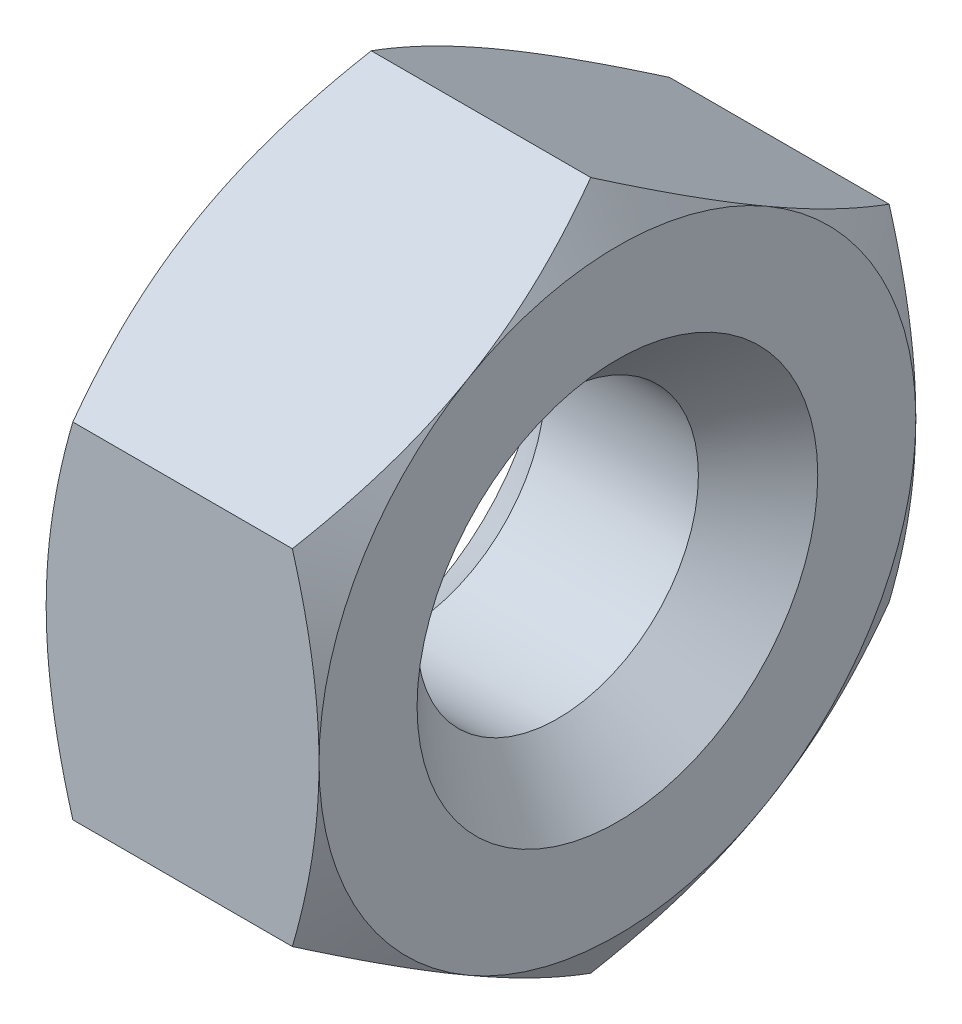
ISO-10303-21;
HEADER;
FILE_DESCRIPTION(('STEP AP214'),'2;1');
FILE_NAME('part.step','',(''),(''),'','','');
FILE_SCHEMA(('AUTOMOTIVE_DESIGN { 1 0 10303 214 1 1 1 1 }'));
ENDSEC;
DATA;
#1=APPLICATION_CONTEXT('core data for automotive mechanical design processes');
#2=APPLICATION_PROTOCOL_DEFINITION('international standard','automotive_design',2000,#1);
#3=PRODUCT_CONTEXT('',#1,'mechanical');
#4=PRODUCT('Part','Part','',(#3));
#5=PRODUCT_RELATED_PRODUCT_CATEGORY('part','',(#4));
#6=PRODUCT_DEFINITION_FORMATION('','',#4);
#7=PRODUCT_DEFINITION_CONTEXT('part definition',#1,'design');
#8=PRODUCT_DEFINITION('design','',#6,#7);
#9=PRODUCT_DEFINITION_SHAPE('','',#8);
#10=(LENGTH_UNIT() NAMED_UNIT(*) SI_UNIT(.MILLI.,.METRE.));
#11=(NAMED_UNIT(*) PLANE_ANGLE_UNIT() SI_UNIT($,.RADIAN.));
#12=(NAMED_UNIT(*) SI_UNIT($,.STERADIAN.) SOLID_ANGLE_UNIT());
#13=UNCERTAINTY_MEASURE_WITH_UNIT(LENGTH_MEASURE(1.E-05),#10,'distance_accuracy_value','');
#14=(GEOMETRIC_REPRESENTATION_CONTEXT(3) GLOBAL_UNCERTAINTY_ASSIGNED_CONTEXT((#13)) GLOBAL_UNIT_ASSIGNED_CONTEXT((#10,
#11,#12)) REPRESENTATION_CONTEXT('',''));
#15=CARTESIAN_POINT('',(0.,0.,0.));
#16=DIRECTION('',(0.,0.,1.));
#17=DIRECTION('',(1.,0.,0.));
#18=AXIS2_PLACEMENT_3D('',#15,#16,#17);
#19=CARTESIAN_POINT('',(-1.6,0.,0.));
#20=DIRECTION('',(1.,0.,0.));
#21=DIRECTION('',(0.,0.,-1.));
#22=AXIS2_PLACEMENT_3D('',#19,#20,#21);
#23=PLANE('',#22);
#24=CARTESIAN_POINT('',(-1.6,0.,0.));
#25=DIRECTION('',(1.,0.,0.));
#26=DIRECTION('',(0.,0.,-1.));
#27=AXIS2_PLACEMENT_3D('',#24,#25,#26);
#28=CIRCLE('',#27,2.35);
#29=CARTESIAN_POINT('',(-1.6,0.,-2.35));
#30=VERTEX_POINT('',#29);
#31=EDGE_CURVE('E11',#30,#30,#28,.T.);
#32=ORIENTED_EDGE('',*,*,#31,.T.);
#33=EDGE_LOOP('',(#32));
#34=FACE_BOUND('',#33,.T.);
#35=CARTESIAN_POINT('',(-1.6,0.,0.));
#36=DIRECTION('',(1.,0.,0.));
#37=DIRECTION('',(0.,0.,-1.));
#38=AXIS2_PLACEMENT_3D('',#35,#36,#37);
#39=CIRCLE('',#38,3.5);
#40=CARTESIAN_POINT('',(-1.6,0.,-3.5));
#41=VERTEX_POINT('',#40);
#42=CARTESIAN_POINT('',(-1.6,3.03108891324553,-1.75));
#43=VERTEX_POINT('',#42);
#44=EDGE_CURVE('E174',#41,#43,#39,.T.);
#45=ORIENTED_EDGE('',*,*,#44,.F.);
#46=CARTESIAN_POINT('',(-1.6,-3.03108891324554,-1.75));
#47=VERTEX_POINT('',#46);
#48=EDGE_CURVE('E164',#47,#41,#39,.T.);
#49=ORIENTED_EDGE('',*,*,#48,.F.);
#50=CARTESIAN_POINT('',(-1.6,-3.03108891324554,1.75));
#51=VERTEX_POINT('',#50);
#52=EDGE_CURVE('E173',#51,#47,#39,.T.);
#53=ORIENTED_EDGE('',*,*,#52,.F.);
#54=CARTESIAN_POINT('',(-1.6,0.,3.5));
#55=VERTEX_POINT('',#54);
#56=EDGE_CURVE('E336',#55,#51,#39,.T.);
#57=ORIENTED_EDGE('',*,*,#56,.F.);
#58=CARTESIAN_POINT('',(-1.6,0.,0.));
#59=DIRECTION('',(-1.,0.,0.));
#60=DIRECTION('',(0.,0.,1.));
#61=AXIS2_PLACEMENT_3D('',#58,#59,#60);
#62=CIRCLE('',#61,3.5);
#63=CARTESIAN_POINT('',(-1.6,3.03108891324553,1.75));
#64=VERTEX_POINT('',#63);
#65=EDGE_CURVE('E139',#55,#64,#62,.T.);
#66=ORIENTED_EDGE('',*,*,#65,.T.);
#67=EDGE_CURVE('E211',#43,#64,#39,.T.);
#68=ORIENTED_EDGE('',*,*,#67,.F.);
#69=EDGE_LOOP('',(#45,#49,#53,#57,#66,#68));
#70=FACE_BOUND('',#69,.T.);
#71=ADVANCED_FACE('F41',(#34,#70),#23,.F.);
#72=CARTESIAN_POINT('',(-1.6,0.,0.));
#73=DIRECTION('',(1.,0.,0.));
#74=DIRECTION('',(0.,0.,-1.));
#75=AXIS2_PLACEMENT_3D('',#72,#73,#74);
#76=CONICAL_SURFACE('',#75,3.5,1.0471975511966);
#77=CARTESIAN_POINT('',(-1.28732593930663,-2.02061047210985,-3.5002));
#78=CARTESIAN_POINT('',(-1.33861421101002,-2.10941108799267,-3.34639282154755));
#79=CARTESIAN_POINT('',(-1.3852590461838,-2.19897822522909,-3.19125798916558));
#80=CARTESIAN_POINT('',(-1.46667812446665,-2.37966345361545,-2.87830199342322));
#81=CARTESIAN_POINT('',(-1.50142356441544,-2.47078475532382,-2.7204752692125));
#82=CARTESIAN_POINT('',(-1.55550997281717,-2.65189807961073,-2.40677778961987));
#83=CARTESIAN_POINT('',(-1.57521091373962,-2.74186223545399,-2.25095530083931));
#84=CARTESIAN_POINT('',(-1.59872986726275,-2.92221386641055,-1.93857711279462));
#85=CARTESIAN_POINT('',(-1.60256735545444,-3.01260068598001,-1.78202254896577));
#86=CARTESIAN_POINT('',(-1.59458469812302,-3.1814939814933,-1.48949078007901));
#87=CARTESIAN_POINT('',(-1.58472456593039,-3.26002573814993,-1.35346978754209));
#88=CARTESIAN_POINT('',(-1.5534735331006,-3.41657761679353,-1.082313979711));
#89=CARTESIAN_POINT('',(-1.5320719567142,-3.49459719728457,-0.947180102315316));
#90=CARTESIAN_POINT('',(-1.47856959211942,-3.65147186489428,-0.675465207594816));
#91=CARTESIAN_POINT('',(-1.44624200555491,-3.73030709667643,-0.538918580721665));
#92=CARTESIAN_POINT('',(-1.37287106619201,-3.88680174018324,-0.267861907055499));
#93=CARTESIAN_POINT('',(-1.33184495343013,-3.96446315689008,-0.133348387531464));
#94=CARTESIAN_POINT('',(-1.28732593930663,-4.04156735438121,0.00019999999999949));
#95=B_SPLINE_CURVE_WITH_KNOTS('',3,(#77,#78,#79,#80,#81,#82,#83,#84,#85,#86,#87,#88,#89,#90,#91,
#92,#93,#94),.UNSPECIFIED.,.F.,.F.,(4,2,2,2,2,2,2,2,4),(0.,0.554793832886254,1.11092123814984,
1.65328467083219,2.19498204478403,2.6666513085086,3.13875761298267,3.62133612600509,
4.10296698719187),.UNSPECIFIED.);
#96=CARTESIAN_POINT('',(-1.28739260883035,-2.0207259421637,-3.5));
#97=VERTEX_POINT('',#96);
#98=EDGE_CURVE('E220',#97,#47,#95,.T.);
#99=ORIENTED_EDGE('',*,*,#98,.T.);
#100=ORIENTED_EDGE('',*,*,#48,.T.);
#101=CARTESIAN_POINT('',(0.426863543923868,6.07444992930714,-3.5));
#102=CARTESIAN_POINT('',(0.35414113345537,5.92905579347162,-3.5));
#103=CARTESIAN_POINT('',(0.281920754218044,5.78340789074987,-3.5));
#104=CARTESIAN_POINT('',(0.138726667982876,5.4914888875327,-3.5));
#105=CARTESIAN_POINT('',(0.0677530446098224,5.34521774604566,-3.5));
#106=CARTESIAN_POINT('',(-0.0728367208627559,5.05166036694925,-3.5));
#107=CARTESIAN_POINT('',(-0.142449837504469,4.9043726773065,-3.5));
#108=CARTESIAN_POINT('',(-0.279833827448935,4.60894249735612,-3.5));
#109=CARTESIAN_POINT('',(-0.347604736832251,4.46080002385884,-3.5));
#110=CARTESIAN_POINT('',(-0.483877652856344,4.15680666864911,-3.5));
#111=CARTESIAN_POINT('',(-0.552275348365052,4.0009088702741,-3.5));
#112=CARTESIAN_POINT('',(-0.685955013898122,3.68778451215992,-3.5));
#113=CARTESIAN_POINT('',(-0.751237092569789,3.53055799898087,-3.5));
#114=CARTESIAN_POINT('',(-0.877811871257592,3.21460320159568,-3.5));
#115=CARTESIAN_POINT('',(-0.939106871192922,3.05587584476856,-3.5));
#116=CARTESIAN_POINT('',(-1.05663516167174,2.73656884975005,-3.5));
#117=CARTESIAN_POINT('',(-1.11286900680599,2.57598941668607,-3.5));
#118=CARTESIAN_POINT('',(-1.23129379752402,2.21476275530516,-3.5));
#119=CARTESIAN_POINT('',(-1.29178990217409,2.01354901348436,-3.5));
#120=CARTESIAN_POINT('',(-1.39948625433688,1.60754163283666,-3.5));
#121=CARTESIAN_POINT('',(-1.44668769650856,1.40274831742799,-3.5));
#122=CARTESIAN_POINT('',(-1.52311318608567,0.99329521038372,-3.5));
#123=CARTESIAN_POINT('',(-1.55262926495085,0.788692357876773,-3.5));
#124=CARTESIAN_POINT('',(-1.58189649721941,0.480430141249324,-3.5));
#125=CARTESIAN_POINT('',(-1.58915110683146,0.377455277759585,-3.5));
#126=CARTESIAN_POINT('',(-1.5984510937656,0.171263024296456,-3.5));
#127=CARTESIAN_POINT('',(-1.60049649299045,0.0680456353446207,-3.5));
#128=CARTESIAN_POINT('',(-1.59929608461118,-0.138969778431405,-3.5));
#129=CARTESIAN_POINT('',(-1.59601885439497,-0.24276761996304,-3.5));
#130=CARTESIAN_POINT('',(-1.58423347380957,-0.450071112344205,-3.5));
#131=CARTESIAN_POINT('',(-1.57572463597305,-0.553576722996653,-3.5));
#132=CARTESIAN_POINT('',(-1.54272381678205,-0.863340734852506,-3.5));
#133=CARTESIAN_POINT('',(-1.51075770827424,-1.06882834658148,-3.5));
#134=CARTESIAN_POINT('',(-1.42968790551854,-1.47989329245037,-3.5));
#135=CARTESIAN_POINT('',(-1.38030122223033,-1.68541238359059,-3.5));
#136=CARTESIAN_POINT('',(-1.26854844500803,-2.0929451191376,-3.5));
#137=CARTESIAN_POINT('',(-1.20617505281566,-2.29495672295401,-3.5));
#138=CARTESIAN_POINT('',(-1.08611384879332,-2.65316006978612,-3.5));
#139=CARTESIAN_POINT('',(-1.03024350536568,-2.80997267147894,-3.5));
#140=CARTESIAN_POINT('',(-0.913850717093393,-3.12180569526495,-3.5));
#141=CARTESIAN_POINT('',(-0.853329552631943,-3.27682659719373,-3.5));
#142=CARTESIAN_POINT('',(-0.728578826220343,-3.5854833686078,-3.5));
#143=CARTESIAN_POINT('',(-0.664346753474012,-3.73911821707236,-3.5));
#144=CARTESIAN_POINT('',(-0.532971191495085,-4.04513930891193,-3.5));
#145=CARTESIAN_POINT('',(-0.465827611913924,-4.19752551336486,-3.5));
#146=CARTESIAN_POINT('',(-0.332098073516447,-4.49483356199442,-3.5));
#147=CARTESIAN_POINT('',(-0.265608344439567,-4.63979882658682,-3.5));
#148=CARTESIAN_POINT('',(-0.130887690123864,-4.92891382225687,-3.5));
#149=CARTESIAN_POINT('',(-0.0626567919056109,-5.07306356594792,-3.5));
#150=CARTESIAN_POINT('',(0.0751140871143628,-5.36042075746468,-3.5));
#151=CARTESIAN_POINT('',(0.144651535043734,-5.50362942211417,-3.5));
#152=CARTESIAN_POINT('',(0.28491978687479,-5.78945656434556,-3.5));
#153=CARTESIAN_POINT('',(0.355650557459631,-5.9320750582667,-3.5));
#154=CARTESIAN_POINT('',(0.426863543923866,-6.07444992930713,-3.5));
#155=B_SPLINE_CURVE_WITH_KNOTS('',3,(#101,#102,#103,#104,#105,#106,#107,#108,#109,#110,#111,
#112,#113,#114,#115,#116,#117,#118,#119,#120,#121,#122,#123,#124,#125,#126,#127,#128,#129,#130,
#131,#132,#133,#134,#135,#136,#137,#138,#139,#140,#141,#142,#143,#144,#145,#146,#147,#148,#149,
#150,#151,#152,#153,#154),.UNSPECIFIED.,.F.,.F.,(4,2,2,2,2,2,2,2,2,2,2,2,2,2,2,2,2,2,2,2,2,2,2,
2,2,2,4),(0.,0.487703339643119,0.975439267503668,1.46415856612573,1.95286828602563,
2.46356761420867,2.97424912033223,3.4846333819682,3.99496164849833,4.62494858948578,
5.25487890174382,5.87409820693503,6.1836748188783,6.49325012916695,6.80465969685065,
7.11611019452977,7.73906486049102,8.37264423544772,9.00658063445292,9.50590419196068,
10.0050907734929,10.5046191521522,11.0041630430593,11.4826076764218,11.9610448894857,
12.4386346406441,12.9162110797799),.UNSPECIFIED.);
#156=EDGE_CURVE('E218',#41,#97,#155,.T.);
#157=ORIENTED_EDGE('',*,*,#156,.T.);
#158=EDGE_LOOP('',(#99,#100,#157));
#159=FACE_BOUND('',#158,.T.);
#160=ADVANCED_FACE('F205',(#159),#76,.T.);
#161=CARTESIAN_POINT('',(-1.28732593930663,-4.04156735438121,-0.000200000000000506));
#162=CARTESIAN_POINT('',(-1.33861421101002,-3.9527667384984,0.153607178452449));
#163=CARTESIAN_POINT('',(-1.3852590461838,-3.86319960126198,0.308742010834423));
#164=CARTESIAN_POINT('',(-1.46667812446665,-3.68251437287562,0.621698006576781));
#165=CARTESIAN_POINT('',(-1.50142356441544,-3.59139307116725,0.779524730787495));
#166=CARTESIAN_POINT('',(-1.55550997281717,-3.41027974688033,1.09322221038013));
#167=CARTESIAN_POINT('',(-1.57521091373962,-3.32031559103708,1.24904469916069));
#168=CARTESIAN_POINT('',(-1.59872986726275,-3.13996396008051,1.56142288720537));
#169=CARTESIAN_POINT('',(-1.60256735545444,-3.04957714051106,1.71797745103423));
#170=CARTESIAN_POINT('',(-1.59458469812302,-2.88068384499777,2.01050921992099));
#171=CARTESIAN_POINT('',(-1.5847245659304,-2.80215208834114,2.14653021245791));
#172=CARTESIAN_POINT('',(-1.5534735331006,-2.64560020969753,2.41768602028899));
#173=CARTESIAN_POINT('',(-1.5320719567142,-2.56758062920649,2.55281989768468));
#174=CARTESIAN_POINT('',(-1.47856959211942,-2.41070596159678,2.82453479240518));
#175=CARTESIAN_POINT('',(-1.44624200555491,-2.33187072981463,2.96108141927834));
#176=CARTESIAN_POINT('',(-1.37287106619201,-2.17537608630782,3.2321380929445));
#177=CARTESIAN_POINT('',(-1.33184495343013,-2.09771466960098,3.36665161246854));
#178=CARTESIAN_POINT('',(-1.28732593930663,-2.02061047210985,3.5002));
#179=B_SPLINE_CURVE_WITH_KNOTS('',3,(#161,#162,#163,#164,#165,#166,#167,#168,#169,#170,#171,
#172,#173,#174,#175,#176,#177,#178),.UNSPECIFIED.,.F.,.F.,(4,2,2,2,2,2,2,2,4),(0.,
0.554793832886254,1.11092123814984,1.65328467083219,2.19498204478403,2.6666513085086,
3.13875761298267,3.6213361260051,4.10296698719187),.UNSPECIFIED.);
#180=CARTESIAN_POINT('',(-1.28739260883035,-4.04145188432738,0.));
#181=VERTEX_POINT('',#180);
#182=EDGE_CURVE('E272',#181,#51,#179,.T.);
#183=ORIENTED_EDGE('',*,*,#182,.T.);
#184=ORIENTED_EDGE('',*,*,#52,.T.);
#185=EDGE_CURVE('E324',#47,#181,#95,.T.);
#186=ORIENTED_EDGE('',*,*,#185,.T.);
#187=EDGE_LOOP('',(#183,#184,#186));
#188=FACE_BOUND('',#187,.T.);
#189=ADVANCED_FACE('F257',(#188),#76,.T.);
#190=CARTESIAN_POINT('',(0.426863543923862,-6.07444992930712,3.5));
#191=CARTESIAN_POINT('',(0.354141133455365,-5.92905579347161,3.5));
#192=CARTESIAN_POINT('',(0.281920754218039,-5.78340789074985,3.5));
#193=CARTESIAN_POINT('',(0.138726667982872,-5.49148888753268,3.5));
#194=CARTESIAN_POINT('',(0.0677530446098183,-5.34521774604565,3.5));
#195=CARTESIAN_POINT('',(-0.0728367208627599,-5.05166036694924,3.5));
#196=CARTESIAN_POINT('',(-0.142449837504473,-4.90437267730649,3.5));
#197=CARTESIAN_POINT('',(-0.279833827448939,-4.60894249735611,3.5));
#198=CARTESIAN_POINT('',(-0.347604736832255,-4.46080002385883,3.5));
#199=CARTESIAN_POINT('',(-0.483877652856347,-4.1568066686491,3.5));
#200=CARTESIAN_POINT('',(-0.552275348365054,-4.0009088702741,3.5));
#201=CARTESIAN_POINT('',(-0.685955013898124,-3.68778451215991,3.5));
#202=CARTESIAN_POINT('',(-0.751237092569792,-3.53055799898086,3.5));
#203=CARTESIAN_POINT('',(-0.877811871257594,-3.21460320159567,3.5));
#204=CARTESIAN_POINT('',(-0.939106871192923,-3.05587584476855,3.5));
#205=CARTESIAN_POINT('',(-1.05663516167174,-2.73656884975004,3.5));
#206=CARTESIAN_POINT('',(-1.11286900680599,-2.57598941668606,3.5));
#207=CARTESIAN_POINT('',(-1.23129379752402,-2.21476275530515,3.5));
#208=CARTESIAN_POINT('',(-1.29178990217409,-2.01354901348435,3.5));
#209=CARTESIAN_POINT('',(-1.39948625433688,-1.60754163283666,3.5));
#210=CARTESIAN_POINT('',(-1.44668769650856,-1.40274831742798,3.5));
#211=CARTESIAN_POINT('',(-1.52311318608567,-0.993295210383717,3.5));
#212=CARTESIAN_POINT('',(-1.55262926495085,-0.788692357876769,3.5));
#213=CARTESIAN_POINT('',(-1.58189649721941,-0.48043014124932,3.5));
#214=CARTESIAN_POINT('',(-1.58915110683146,-0.37745527775958,3.5));
#215=CARTESIAN_POINT('',(-1.5984510937656,-0.171263024296452,3.5));
#216=CARTESIAN_POINT('',(-1.60049649299045,-0.0680456353446164,3.5));
#217=CARTESIAN_POINT('',(-1.59929608461118,0.138969778431409,3.5));
#218=CARTESIAN_POINT('',(-1.59601885439497,0.242767619963043,3.5));
#219=CARTESIAN_POINT('',(-1.58423347380957,0.450071112344208,3.5));
#220=CARTESIAN_POINT('',(-1.57572463597304,0.553576722996656,3.5));
#221=CARTESIAN_POINT('',(-1.54272381678205,0.86334073485251,3.5));
#222=CARTESIAN_POINT('',(-1.51075770827424,1.06882834658148,3.5));
#223=CARTESIAN_POINT('',(-1.42968790551854,1.47989329245038,3.5));
#224=CARTESIAN_POINT('',(-1.38030122223033,1.68541238359059,3.5));
#225=CARTESIAN_POINT('',(-1.26854844500803,2.0929451191376,3.5));
#226=CARTESIAN_POINT('',(-1.20617505281566,2.29495672295401,3.5));
#227=CARTESIAN_POINT('',(-1.08611384879332,2.65316006978612,3.5));
#228=CARTESIAN_POINT('',(-1.03024350536568,2.80997267147894,3.5));
#229=CARTESIAN_POINT('',(-0.913850717093392,3.12180569526496,3.5));
#230=CARTESIAN_POINT('',(-0.853329552631942,3.27682659719373,3.5));
#231=CARTESIAN_POINT('',(-0.728578826220342,3.58548336860781,3.5));
#232=CARTESIAN_POINT('',(-0.66434675347401,3.73911821707237,3.5));
#233=CARTESIAN_POINT('',(-0.532971191495083,4.04513930891193,3.5));
#234=CARTESIAN_POINT('',(-0.465827611913922,4.19752551336487,3.5));
#235=CARTESIAN_POINT('',(-0.332098073516446,4.49483356199442,3.5));
#236=CARTESIAN_POINT('',(-0.265608344439566,4.63979882658683,3.5));
#237=CARTESIAN_POINT('',(-0.130887690123863,4.92891382225687,3.5));
#238=CARTESIAN_POINT('',(-0.0626567919056101,5.07306356594793,3.5));
#239=CARTESIAN_POINT('',(0.0751140871143639,5.36042075746468,3.5));
#240=CARTESIAN_POINT('',(0.144651535043735,5.50362942211417,3.5));
#241=CARTESIAN_POINT('',(0.284919786874791,5.78945656434557,3.5));
#242=CARTESIAN_POINT('',(0.355650557459632,5.9320750582667,3.5));
#243=CARTESIAN_POINT('',(0.426863543923866,6.07444992930713,3.5));
#244=B_SPLINE_CURVE_WITH_KNOTS('',3,(#190,#191,#192,#193,#194,#195,#196,#197,#198,#199,#200,
#201,#202,#203,#204,#205,#206,#207,#208,#209,#210,#211,#212,#213,#214,#215,#216,#217,#218,#219,
#220,#221,#222,#223,#224,#225,#226,#227,#228,#229,#230,#231,#232,#233,#234,#235,#236,#237,#238,
#239,#240,#241,#242,#243),.UNSPECIFIED.,.F.,.F.,(4,2,2,2,2,2,2,2,2,2,2,2,2,2,2,2,2,2,2,2,2,2,2,
2,2,2,4),(0.,0.487703339643117,0.975439267503664,1.46415856612573,1.95286828602562,
2.46356761420867,2.97424912033222,3.48463338196819,3.99496164849832,4.62494858948577,
5.25487890174381,5.87409820693502,6.18367481887829,6.49325012916694,6.80465969685064,
7.11611019452976,7.73906486049101,8.37264423544771,9.00658063445291,9.50590419196067,
10.0050907734929,10.5046191521522,11.0041630430593,11.4826076764218,11.9610448894856,
12.438634640644,12.9162110797799),.UNSPECIFIED.);
#245=CARTESIAN_POINT('',(-1.28739260883035,-2.02072594216368,3.50000000000001));
#246=VERTEX_POINT('',#245);
#247=EDGE_CURVE('E144',#246,#55,#244,.T.);
#248=ORIENTED_EDGE('',*,*,#247,.T.);
#249=ORIENTED_EDGE('',*,*,#56,.T.);
#250=EDGE_CURVE('E145',#51,#246,#179,.T.);
#251=ORIENTED_EDGE('',*,*,#250,.T.);
#252=EDGE_LOOP('',(#248,#249,#251));
#253=FACE_BOUND('',#252,.T.);
#254=ADVANCED_FACE('F252',(#253),#76,.T.);
#255=CARTESIAN_POINT('',(-1.28739260883035,2.0207259421637,3.5));
#256=VERTEX_POINT('',#255);
#257=EDGE_CURVE('E134',#55,#256,#244,.T.);
#258=ORIENTED_EDGE('',*,*,#257,.T.);
#259=CARTESIAN_POINT('',(-1.28732593930663,2.02061047210986,3.5002));
#260=CARTESIAN_POINT('',(-1.33861421101001,2.10941108799267,3.34639282154755));
#261=CARTESIAN_POINT('',(-1.3852590461838,2.1989782252291,3.19125798916558));
#262=CARTESIAN_POINT('',(-1.46667812446665,2.37966345361545,2.87830199342322));
#263=CARTESIAN_POINT('',(-1.50142356441544,2.47078475532383,2.7204752692125));
#264=CARTESIAN_POINT('',(-1.55550997281716,2.65189807961074,2.40677778961987));
#265=CARTESIAN_POINT('',(-1.57521091373962,2.741862235454,2.25095530083931));
#266=CARTESIAN_POINT('',(-1.59872986726274,2.92221386641056,1.93857711279462));
#267=CARTESIAN_POINT('',(-1.60256735545443,3.01260068598002,1.78202254896577));
#268=CARTESIAN_POINT('',(-1.59458469812302,3.1814939814933,1.48949078007901));
#269=CARTESIAN_POINT('',(-1.58472456593039,3.26002573814993,1.35346978754209));
#270=CARTESIAN_POINT('',(-1.55347353310059,3.41657761679354,1.08231397971101));
#271=CARTESIAN_POINT('',(-1.5320719567142,3.49459719728458,0.947180102315317));
#272=CARTESIAN_POINT('',(-1.47856959211942,3.65147186489429,0.675465207594816));
#273=CARTESIAN_POINT('',(-1.44624200555491,3.73030709667644,0.538918580721665));
#274=CARTESIAN_POINT('',(-1.372871066192,3.88680174018325,0.267861907055499));
#275=CARTESIAN_POINT('',(-1.33184495343013,3.96446315689009,0.133348387531465));
#276=CARTESIAN_POINT('',(-1.28732593930663,4.04156735438122,-0.000199999999998678));
#277=B_SPLINE_CURVE_WITH_KNOTS('',3,(#259,#260,#261,#262,#263,#264,#265,#266,#267,#268,#269,
#270,#271,#272,#273,#274,#275,#276),.UNSPECIFIED.,.F.,.F.,(4,2,2,2,2,2,2,2,4),(0.,
0.554793832886254,1.11092123814984,1.65328467083219,2.19498204478403,2.6666513085086,
3.13875761298267,3.6213361260051,4.10296698719187),.UNSPECIFIED.);
#278=EDGE_CURVE('E137',#256,#64,#277,.T.);
#279=ORIENTED_EDGE('',*,*,#278,.T.);
#280=ORIENTED_EDGE('',*,*,#65,.F.);
#281=EDGE_LOOP('',(#258,#279,#280));
#282=FACE_BOUND('',#281,.T.);
#283=ADVANCED_FACE('F136',(#282),#76,.T.);
#284=CARTESIAN_POINT('',(-1.28739260883035,4.04145188432738,0.));
#285=VERTEX_POINT('',#284);
#286=EDGE_CURVE('E155',#64,#285,#277,.T.);
#287=ORIENTED_EDGE('',*,*,#286,.T.);
#288=CARTESIAN_POINT('',(-1.28732593930662,4.04156735438122,0.000200000000001443));
#289=CARTESIAN_POINT('',(-1.33861421101001,3.9527667384984,-0.153607178452448));
#290=CARTESIAN_POINT('',(-1.3852590461838,3.86319960126198,-0.308742010834423));
#291=CARTESIAN_POINT('',(-1.46667812446665,3.68251437287563,-0.621698006576781));
#292=CARTESIAN_POINT('',(-1.50142356441544,3.59139307116725,-0.779524730787496));
#293=CARTESIAN_POINT('',(-1.55550997281716,3.41027974688034,-1.09322221038013));
#294=CARTESIAN_POINT('',(-1.57521091373962,3.32031559103708,-1.24904469916069));
#295=CARTESIAN_POINT('',(-1.59872986726274,3.13996396008052,-1.56142288720538));
#296=CARTESIAN_POINT('',(-1.60256735545443,3.04957714051106,-1.71797745103423));
#297=CARTESIAN_POINT('',(-1.59458469812302,2.88068384499778,-2.01050921992099));
#298=CARTESIAN_POINT('',(-1.58472456593039,2.80215208834115,-2.14653021245791));
#299=CARTESIAN_POINT('',(-1.55347353310059,2.64560020969754,-2.417686020289));
#300=CARTESIAN_POINT('',(-1.5320719567142,2.5675806292065,-2.55281989768468));
#301=CARTESIAN_POINT('',(-1.47856959211942,2.41070596159679,-2.82453479240518));
#302=CARTESIAN_POINT('',(-1.44624200555491,2.33187072981464,-2.96108141927833));
#303=CARTESIAN_POINT('',(-1.372871066192,2.17537608630783,-3.2321380929445));
#304=CARTESIAN_POINT('',(-1.33184495343013,2.09771466960099,-3.36665161246853));
#305=CARTESIAN_POINT('',(-1.28732593930663,2.02061047210986,-3.5002));
#306=B_SPLINE_CURVE_WITH_KNOTS('',3,(#288,#289,#290,#291,#292,#293,#294,#295,#296,#297,#298,
#299,#300,#301,#302,#303,#304,#305),.UNSPECIFIED.,.F.,.F.,(4,2,2,2,2,2,2,2,4),(0.,
0.554793832886255,1.11092123814984,1.65328467083219,2.19498204478404,2.6666513085086,
3.13875761298267,3.6213361260051,4.10296698719187),.UNSPECIFIED.);
#307=EDGE_CURVE('E65',#285,#43,#306,.T.);
#308=ORIENTED_EDGE('',*,*,#307,.T.);
#309=ORIENTED_EDGE('',*,*,#67,.T.);
#310=EDGE_LOOP('',(#287,#308,#309));
#311=FACE_BOUND('',#310,.T.);
#312=ADVANCED_FACE('F467',(#311),#76,.T.);
#313=CARTESIAN_POINT('',(-1.28739260883035,2.0207259421637,-3.5));
#314=VERTEX_POINT('',#313);
#315=EDGE_CURVE('E224',#43,#314,#306,.T.);
#316=ORIENTED_EDGE('',*,*,#315,.T.);
#317=EDGE_CURVE('E222',#314,#41,#155,.T.);
#318=ORIENTED_EDGE('',*,*,#317,.T.);
#319=ORIENTED_EDGE('',*,*,#44,.T.);
#320=EDGE_LOOP('',(#316,#318,#319));
#321=FACE_BOUND('',#320,.T.);
#322=ADVANCED_FACE('F223',(#321),#76,.T.);
#323=CARTESIAN_POINT('',(1.6,2.0207259421637,-3.5));
#324=DIRECTION('',(0.,-0.866025403784438,0.5));
#325=DIRECTION('',(0.,-0.5,-0.866025403784439));
#326=AXIS2_PLACEMENT_3D('',#323,#324,#325);
#327=PLANE('',#326);
#328=CARTESIAN_POINT('',(1.28732593930663,2.02061047210986,-3.5002));
#329=CARTESIAN_POINT('',(1.33861421101001,2.10941108799268,-3.34639282154755));
#330=CARTESIAN_POINT('',(1.3852590461838,2.1989782252291,-3.19125798916557));
#331=CARTESIAN_POINT('',(1.46667812446665,2.37966345361545,-2.87830199342322));
#332=CARTESIAN_POINT('',(1.50142356441544,2.47078475532383,-2.7204752692125));
#333=CARTESIAN_POINT('',(1.55550997281716,2.65189807961074,-2.40677778961987));
#334=CARTESIAN_POINT('',(1.57521091373962,2.741862235454,-2.2509553008393));
#335=CARTESIAN_POINT('',(1.59872986726274,2.92221386641056,-1.93857711279462));
#336=CARTESIAN_POINT('',(1.60256735545443,3.01260068598002,-1.78202254896577));
#337=CARTESIAN_POINT('',(1.59458469812302,3.1814939814933,-1.48949078007901));
#338=CARTESIAN_POINT('',(1.58472456593039,3.26002573814993,-1.35346978754209));
#339=CARTESIAN_POINT('',(1.55347353310059,3.41657761679354,-1.082313979711));
#340=CARTESIAN_POINT('',(1.5320719567142,3.49459719728458,-0.947180102315314));
#341=CARTESIAN_POINT('',(1.47856959211942,3.65147186489429,-0.675465207594814));
#342=CARTESIAN_POINT('',(1.44624200555491,3.73030709667644,-0.538918580721662));
#343=CARTESIAN_POINT('',(1.372871066192,3.88680174018325,-0.267861907055496));
#344=CARTESIAN_POINT('',(1.33184495343013,3.96446315689009,-0.133348387531462));
#345=CARTESIAN_POINT('',(1.28732593930662,4.04156735438122,0.000200000000001475));
#346=B_SPLINE_CURVE_WITH_KNOTS('',3,(#328,#329,#330,#331,#332,#333,#334,#335,#336,#337,#338,
#339,#340,#341,#342,#343,#344,#345),.UNSPECIFIED.,.F.,.F.,(4,2,2,2,2,2,2,2,4),(0.,
0.554793832886254,1.11092123814984,1.65328467083219,2.19498204478403,2.6666513085086,
3.13875761298267,3.6213361260051,4.10296698719187),.UNSPECIFIED.);
#347=CARTESIAN_POINT('',(1.28739260883035,2.0207259421637,-3.5));
#348=VERTEX_POINT('',#347);
#349=CARTESIAN_POINT('',(1.6,3.03108891324553,-1.75));
#350=VERTEX_POINT('',#349);
#351=EDGE_CURVE('E316',#348,#350,#346,.T.);
#352=ORIENTED_EDGE('',*,*,#351,.F.);
#353=DIRECTION('',(-1.,0.,0.));
#354=VECTOR('',#353,1.);
#355=CARTESIAN_POINT('',(1.6,2.0207259421637,-3.5));
#356=LINE('',#355,#354);
#357=EDGE_CURVE('E317',#348,#314,#356,.T.);
#358=ORIENTED_EDGE('',*,*,#357,.T.);
#359=ORIENTED_EDGE('',*,*,#315,.F.);
#360=ORIENTED_EDGE('',*,*,#307,.F.);
#361=DIRECTION('',(-1.,0.,0.));
#362=VECTOR('',#361,1.);
#363=CARTESIAN_POINT('',(1.6,4.04145188432739,0.));
#364=LINE('',#363,#362);
#365=CARTESIAN_POINT('',(1.28739260883035,4.04145188432739,0.));
#366=VERTEX_POINT('',#365);
#367=EDGE_CURVE('E161',#366,#285,#364,.T.);
#368=ORIENTED_EDGE('',*,*,#367,.F.);
#369=EDGE_CURVE('E310',#350,#366,#346,.T.);
#370=ORIENTED_EDGE('',*,*,#369,.F.);
#371=EDGE_LOOP('',(#352,#358,#359,#360,#368,#370));
#372=FACE_BOUND('',#371,.T.);
#373=ADVANCED_FACE('F291',(#372),#327,.F.);
#374=CARTESIAN_POINT('',(1.6,4.04145188432739,0.));
#375=DIRECTION('',(0.,-0.866025403784438,-0.5));
#376=DIRECTION('',(0.,0.5,-0.866025403784439));
#377=AXIS2_PLACEMENT_3D('',#374,#375,#376);
#378=PLANE('',#377);
#379=CARTESIAN_POINT('',(1.28732593930662,4.04156735438122,-0.000199999999998624));
#380=CARTESIAN_POINT('',(1.33861421101001,3.9527667384984,0.153607178452451));
#381=CARTESIAN_POINT('',(1.3852590461838,3.86319960126198,0.308742010834426));
#382=CARTESIAN_POINT('',(1.46667812446665,3.68251437287563,0.621698006576784));
#383=CARTESIAN_POINT('',(1.50142356441544,3.59139307116725,0.779524730787499));
#384=CARTESIAN_POINT('',(1.55550997281716,3.41027974688034,1.09322221038013));
#385=CARTESIAN_POINT('',(1.57521091373962,3.32031559103708,1.2490446991607));
#386=CARTESIAN_POINT('',(1.59872986726274,3.13996396008052,1.56142288720538));
#387=CARTESIAN_POINT('',(1.60256735545443,3.04957714051106,1.71797745103424));
#388=CARTESIAN_POINT('',(1.59458469812302,2.88068384499777,2.01050921992099));
#389=CARTESIAN_POINT('',(1.58472456593039,2.80215208834115,2.14653021245791));
#390=CARTESIAN_POINT('',(1.55347353310059,2.64560020969754,2.417686020289));
#391=CARTESIAN_POINT('',(1.5320719567142,2.5675806292065,2.55281989768469));
#392=CARTESIAN_POINT('',(1.47856959211942,2.41070596159679,2.82453479240519));
#393=CARTESIAN_POINT('',(1.44624200555491,2.33187072981464,2.96108141927834));
#394=CARTESIAN_POINT('',(1.372871066192,2.17537608630783,3.2321380929445));
#395=CARTESIAN_POINT('',(1.33184495343013,2.09771466960099,3.36665161246854));
#396=CARTESIAN_POINT('',(1.28732593930663,2.02061047210986,3.5002));
#397=B_SPLINE_CURVE_WITH_KNOTS('',3,(#379,#380,#381,#382,#383,#384,#385,#386,#387,#388,#389,
#390,#391,#392,#393,#394,#395,#396),.UNSPECIFIED.,.F.,.F.,(4,2,2,2,2,2,2,2,4),(0.,
0.554793832886255,1.11092123814984,1.65328467083219,2.19498204478404,2.6666513085086,
3.13875761298267,3.6213361260051,4.10296698719187),.UNSPECIFIED.);
#398=CARTESIAN_POINT('',(1.6,3.03108891324553,1.75));
#399=VERTEX_POINT('',#398);
#400=EDGE_CURVE('E303',#366,#399,#397,.T.);
#401=ORIENTED_EDGE('',*,*,#400,.F.);
#402=ORIENTED_EDGE('',*,*,#367,.T.);
#403=ORIENTED_EDGE('',*,*,#286,.F.);
#404=ORIENTED_EDGE('',*,*,#278,.F.);
#405=DIRECTION('',(-1.,0.,0.));
#406=VECTOR('',#405,1.);
#407=CARTESIAN_POINT('',(1.6,2.02072594216369,3.5));
#408=LINE('',#407,#406);
#409=CARTESIAN_POINT('',(1.28739260883035,2.0207259421637,3.5));
#410=VERTEX_POINT('',#409);
#411=EDGE_CURVE('E153',#410,#256,#408,.T.);
#412=ORIENTED_EDGE('',*,*,#411,.F.);
#413=EDGE_CURVE('E296',#399,#410,#397,.T.);
#414=ORIENTED_EDGE('',*,*,#413,.F.);
#415=EDGE_LOOP('',(#401,#402,#403,#404,#412,#414));
#416=FACE_BOUND('',#415,.T.);
#417=ADVANCED_FACE('F151',(#416),#378,.F.);
#418=CARTESIAN_POINT('',(1.6,2.02072594216369,3.5));
#419=DIRECTION('',(0.,0.,-1.));
#420=DIRECTION('',(-1.,0.,0.));
#421=AXIS2_PLACEMENT_3D('',#418,#419,#420);
#422=PLANE('',#421);
#423=CARTESIAN_POINT('',(-0.426863543923868,6.07444992930713,3.5));
#424=CARTESIAN_POINT('',(-0.35414113345537,5.92905579347161,3.5));
#425=CARTESIAN_POINT('',(-0.281920754218044,5.78340789074986,3.5));
#426=CARTESIAN_POINT('',(-0.138726667982876,5.49148888753269,3.5));
#427=CARTESIAN_POINT('',(-0.0677530446098225,5.34521774604565,3.5));
#428=CARTESIAN_POINT('',(0.072836720862756,5.05166036694924,3.5));
#429=CARTESIAN_POINT('',(0.142449837504469,4.9043726773065,3.5));
#430=CARTESIAN_POINT('',(0.279833827448935,4.60894249735612,3.5));
#431=CARTESIAN_POINT('',(0.347604736832251,4.46080002385884,3.5));
#432=CARTESIAN_POINT('',(0.483877652856344,4.15680666864911,3.5));
#433=CARTESIAN_POINT('',(0.552275348365051,4.0009088702741,3.5));
#434=CARTESIAN_POINT('',(0.685955013898122,3.68778451215992,3.5));
#435=CARTESIAN_POINT('',(0.751237092569789,3.53055799898087,3.5));
#436=CARTESIAN_POINT('',(0.877811871257591,3.21460320159568,3.5));
#437=CARTESIAN_POINT('',(0.939106871192921,3.05587584476856,3.5));
#438=CARTESIAN_POINT('',(1.05663516167174,2.73656884975005,3.5));
#439=CARTESIAN_POINT('',(1.11286900680599,2.57598941668607,3.5));
#440=CARTESIAN_POINT('',(1.23129379752402,2.21476275530516,3.5));
#441=CARTESIAN_POINT('',(1.29178990217409,2.01354901348436,3.5));
#442=CARTESIAN_POINT('',(1.39948625433687,1.60754163283666,3.5));
#443=CARTESIAN_POINT('',(1.44668769650856,1.40274831742799,3.5));
#444=CARTESIAN_POINT('',(1.52311318608567,0.99329521038372,3.5));
#445=CARTESIAN_POINT('',(1.55262926495085,0.788692357876773,3.5));
#446=CARTESIAN_POINT('',(1.58189649721941,0.480430141249323,3.5));
#447=CARTESIAN_POINT('',(1.58915110683146,0.377455277759584,3.5));
#448=CARTESIAN_POINT('',(1.5984510937656,0.171263024296455,3.5));
#449=CARTESIAN_POINT('',(1.60049649299045,0.0680456353446202,3.5));
#450=CARTESIAN_POINT('',(1.59929608461118,-0.138969778431405,3.5));
#451=CARTESIAN_POINT('',(1.59601885439497,-0.24276761996304,3.5));
#452=CARTESIAN_POINT('',(1.58423347380957,-0.450071112344205,3.5));
#453=CARTESIAN_POINT('',(1.57572463597305,-0.553576722996653,3.5));
#454=CARTESIAN_POINT('',(1.54272381678205,-0.863340734852506,3.5));
#455=CARTESIAN_POINT('',(1.51075770827424,-1.06882834658148,3.5));
#456=CARTESIAN_POINT('',(1.42968790551854,-1.47989329245037,3.5));
#457=CARTESIAN_POINT('',(1.38030122223033,-1.68541238359059,3.5));
#458=CARTESIAN_POINT('',(1.26854844500803,-2.0929451191376,3.5));
#459=CARTESIAN_POINT('',(1.20617505281566,-2.29495672295401,3.5));
#460=CARTESIAN_POINT('',(1.08611384879332,-2.65316006978612,3.5));
#461=CARTESIAN_POINT('',(1.03024350536568,-2.80997267147894,3.5));
#462=CARTESIAN_POINT('',(0.913850717093393,-3.12180569526495,3.5));
#463=CARTESIAN_POINT('',(0.853329552631944,-3.27682659719373,3.5));
#464=CARTESIAN_POINT('',(0.728578826220345,-3.5854833686078,3.5));
#465=CARTESIAN_POINT('',(0.664346753474013,-3.73911821707236,3.5));
#466=CARTESIAN_POINT('',(0.532971191495086,-4.04513930891193,3.5));
#467=CARTESIAN_POINT('',(0.465827611913925,-4.19752551336486,3.5));
#468=CARTESIAN_POINT('',(0.332098073516449,-4.49483356199441,3.5));
#469=CARTESIAN_POINT('',(0.265608344439569,-4.63979882658682,3.5));
#470=CARTESIAN_POINT('',(0.130887690123865,-4.92891382225687,3.5));
#471=CARTESIAN_POINT('',(0.0626567919056122,-5.07306356594792,3.5));
#472=CARTESIAN_POINT('',(-0.0751140871143616,-5.36042075746467,3.5));
#473=CARTESIAN_POINT('',(-0.144651535043733,-5.50362942211416,3.5));
#474=CARTESIAN_POINT('',(-0.284919786874789,-5.78945656434556,3.5));
#475=CARTESIAN_POINT('',(-0.355650557459629,-5.93207505826669,3.5));
#476=CARTESIAN_POINT('',(-0.426863543923863,-6.07444992930712,3.5));
#477=B_SPLINE_CURVE_WITH_KNOTS('',3,(#423,#424,#425,#426,#427,#428,#429,#430,#431,#432,#433,
#434,#435,#436,#437,#438,#439,#440,#441,#442,#443,#444,#445,#446,#447,#448,#449,#450,#451,#452,
#453,#454,#455,#456,#457,#458,#459,#460,#461,#462,#463,#464,#465,#466,#467,#468,#469,#470,#471,
#472,#473,#474,#475,#476),.UNSPECIFIED.,.F.,.F.,(4,2,2,2,2,2,2,2,2,2,2,2,2,2,2,2,2,2,2,2,2,2,2,
2,2,2,4),(0.,0.487703339643119,0.975439267503667,1.46415856612573,1.95286828602562,
2.46356761420867,2.97424912033223,3.4846333819682,3.99496164849833,4.62494858948578,
5.25487890174381,5.87409820693503,6.18367481887829,6.49325012916695,6.80465969685065,
7.11611019452977,7.73906486049101,8.37264423544772,9.00658063445292,9.50590419196067,
10.0050907734929,10.5046191521522,11.0041630430593,11.4826076764218,11.9610448894856,
12.438634640644,12.9162110797799),.UNSPECIFIED.);
#478=CARTESIAN_POINT('',(1.6,0.,3.5));
#479=VERTEX_POINT('',#478);
#480=EDGE_CURVE('E160',#410,#479,#477,.T.);
#481=ORIENTED_EDGE('',*,*,#480,.F.);
#482=ORIENTED_EDGE('',*,*,#411,.T.);
#483=ORIENTED_EDGE('',*,*,#257,.F.);
#484=ORIENTED_EDGE('',*,*,#247,.F.);
#485=DIRECTION('',(-1.,0.,0.));
#486=VECTOR('',#485,1.);
#487=CARTESIAN_POINT('',(1.6,-2.02072594216369,3.5));
#488=LINE('',#487,#486);
#489=CARTESIAN_POINT('',(1.28739260883035,-2.02072594216368,3.50000000000001));
#490=VERTEX_POINT('',#489);
#491=EDGE_CURVE('E162',#490,#246,#488,.T.);
#492=ORIENTED_EDGE('',*,*,#491,.F.);
#493=EDGE_CURVE('E304',#479,#490,#477,.T.);
#494=ORIENTED_EDGE('',*,*,#493,.F.);
#495=EDGE_LOOP('',(#481,#482,#483,#484,#492,#494));
#496=FACE_BOUND('',#495,.T.);
#497=ADVANCED_FACE('F158',(#496),#422,.F.);
#498=CARTESIAN_POINT('',(1.6,-2.02072594216369,3.5));
#499=DIRECTION('',(0.,0.866025403784439,-0.5));
#500=DIRECTION('',(0.,0.5,0.866025403784439));
#501=AXIS2_PLACEMENT_3D('',#498,#499,#500);
#502=PLANE('',#501);
#503=CARTESIAN_POINT('',(1.28732593930663,-2.02061047210985,3.5002));
#504=CARTESIAN_POINT('',(1.33861421101002,-2.10941108799267,3.34639282154755));
#505=CARTESIAN_POINT('',(1.3852590461838,-2.19897822522909,3.19125798916558));
#506=CARTESIAN_POINT('',(1.46667812446665,-2.37966345361544,2.87830199342322));
#507=CARTESIAN_POINT('',(1.50142356441544,-2.47078475532382,2.7204752692125));
#508=CARTESIAN_POINT('',(1.55550997281717,-2.65189807961073,2.40677778961987));
#509=CARTESIAN_POINT('',(1.57521091373962,-2.74186223545399,2.25095530083931));
#510=CARTESIAN_POINT('',(1.59872986726275,-2.92221386641055,1.93857711279463));
#511=CARTESIAN_POINT('',(1.60256735545444,-3.01260068598001,1.78202254896577));
#512=CARTESIAN_POINT('',(1.59458469812302,-3.18149398149329,1.48949078007901));
#513=CARTESIAN_POINT('',(1.5847245659304,-3.26002573814992,1.35346978754209));
#514=CARTESIAN_POINT('',(1.5534735331006,-3.41657761679353,1.082313979711));
#515=CARTESIAN_POINT('',(1.5320719567142,-3.49459719728457,0.947180102315317));
#516=CARTESIAN_POINT('',(1.47856959211942,-3.65147186489428,0.675465207594816));
#517=CARTESIAN_POINT('',(1.44624200555491,-3.73030709667643,0.538918580721664));
#518=CARTESIAN_POINT('',(1.37287106619201,-3.88680174018324,0.267861907055498));
#519=CARTESIAN_POINT('',(1.33184495343013,-3.96446315689008,0.133348387531463));
#520=CARTESIAN_POINT('',(1.28732593930663,-4.04156735438121,-0.000200000000000634));
#521=B_SPLINE_CURVE_WITH_KNOTS('',3,(#503,#504,#505,#506,#507,#508,#509,#510,#511,#512,#513,
#514,#515,#516,#517,#518,#519,#520),.UNSPECIFIED.,.F.,.F.,(4,2,2,2,2,2,2,2,4),(0.,
0.554793832886254,1.11092123814984,1.65328467083219,2.19498204478403,2.6666513085086,
3.13875761298267,3.6213361260051,4.10296698719187),.UNSPECIFIED.);
#522=CARTESIAN_POINT('',(1.6,-3.03108891324554,1.75));
#523=VERTEX_POINT('',#522);
#524=EDGE_CURVE('E339',#490,#523,#521,.T.);
#525=ORIENTED_EDGE('',*,*,#524,.F.);
#526=ORIENTED_EDGE('',*,*,#491,.T.);
#527=ORIENTED_EDGE('',*,*,#250,.F.);
#528=ORIENTED_EDGE('',*,*,#182,.F.);
#529=DIRECTION('',(-1.,0.,0.));
#530=VECTOR('',#529,1.);
#531=CARTESIAN_POINT('',(1.6,-4.04145188432738,0.));
#532=LINE('',#531,#530);
#533=CARTESIAN_POINT('',(1.28739260883035,-4.04145188432739,0.));
#534=VERTEX_POINT('',#533);
#535=EDGE_CURVE('E167',#534,#181,#532,.T.);
#536=ORIENTED_EDGE('',*,*,#535,.F.);
#537=EDGE_CURVE('E332',#523,#534,#521,.T.);
#538=ORIENTED_EDGE('',*,*,#537,.F.);
#539=EDGE_LOOP('',(#525,#526,#527,#528,#536,#538));
#540=FACE_BOUND('',#539,.T.);
#541=ADVANCED_FACE('F331',(#540),#502,.F.);
#542=CARTESIAN_POINT('',(1.6,-4.04145188432738,0.));
#543=DIRECTION('',(0.,0.866025403784439,0.5));
#544=DIRECTION('',(0.,-0.5,0.866025403784439));
#545=AXIS2_PLACEMENT_3D('',#542,#543,#544);
#546=PLANE('',#545);
#547=CARTESIAN_POINT('',(1.28732593930663,-4.04156735438121,0.000199999999999566));
#548=CARTESIAN_POINT('',(1.33861421101002,-3.9527667384984,-0.15360717845245));
#549=CARTESIAN_POINT('',(1.3852590461838,-3.86319960126198,-0.308742010834424));
#550=CARTESIAN_POINT('',(1.46667812446665,-3.68251437287562,-0.621698006576782));
#551=CARTESIAN_POINT('',(1.50142356441544,-3.59139307116725,-0.779524730787497));
#552=CARTESIAN_POINT('',(1.55550997281717,-3.41027974688033,-1.09322221038013));
#553=CARTESIAN_POINT('',(1.57521091373962,-3.32031559103708,-1.24904469916069));
#554=CARTESIAN_POINT('',(1.59872986726275,-3.13996396008051,-1.56142288720538));
#555=CARTESIAN_POINT('',(1.60256735545444,-3.04957714051106,-1.71797745103423));
#556=CARTESIAN_POINT('',(1.59458469812302,-2.88068384499777,-2.01050921992099));
#557=CARTESIAN_POINT('',(1.58472456593039,-2.80215208834114,-2.14653021245791));
#558=CARTESIAN_POINT('',(1.5534735331006,-2.64560020969753,-2.417686020289));
#559=CARTESIAN_POINT('',(1.5320719567142,-2.56758062920649,-2.55281989768468));
#560=CARTESIAN_POINT('',(1.47856959211942,-2.41070596159678,-2.82453479240518));
#561=CARTESIAN_POINT('',(1.44624200555491,-2.33187072981463,-2.96108141927834));
#562=CARTESIAN_POINT('',(1.37287106619201,-2.17537608630783,-3.2321380929445));
#563=CARTESIAN_POINT('',(1.33184495343013,-2.09771466960098,-3.36665161246854));
#564=CARTESIAN_POINT('',(1.28732593930663,-2.02061047210985,-3.5002));
#565=B_SPLINE_CURVE_WITH_KNOTS('',3,(#547,#548,#549,#550,#551,#552,#553,#554,#555,#556,#557,
#558,#559,#560,#561,#562,#563,#564),.UNSPECIFIED.,.F.,.F.,(4,2,2,2,2,2,2,2,4),(0.,
0.554793832886254,1.11092123814984,1.65328467083219,2.19498204478403,2.6666513085086,
3.13875761298267,3.6213361260051,4.10296698719187),.UNSPECIFIED.);
#566=CARTESIAN_POINT('',(1.6,-3.03108891324554,-1.75));
#567=VERTEX_POINT('',#566);
#568=EDGE_CURVE('E326',#534,#567,#565,.T.);
#569=ORIENTED_EDGE('',*,*,#568,.F.);
#570=ORIENTED_EDGE('',*,*,#535,.T.);
#571=ORIENTED_EDGE('',*,*,#185,.F.);
#572=ORIENTED_EDGE('',*,*,#98,.F.);
#573=DIRECTION('',(-1.,0.,0.));
#574=VECTOR('',#573,1.);
#575=CARTESIAN_POINT('',(1.6,-2.02072594216369,-3.5));
#576=LINE('',#575,#574);
#577=CARTESIAN_POINT('',(1.28739260883035,-2.0207259421637,-3.5));
#578=VERTEX_POINT('',#577);
#579=EDGE_CURVE('E233',#578,#97,#576,.T.);
#580=ORIENTED_EDGE('',*,*,#579,.F.);
#581=EDGE_CURVE('E348',#567,#578,#565,.T.);
#582=ORIENTED_EDGE('',*,*,#581,.F.);
#583=EDGE_LOOP('',(#569,#570,#571,#572,#580,#582));
#584=FACE_BOUND('',#583,.T.);
#585=ADVANCED_FACE('F323',(#584),#546,.F.);
#586=CARTESIAN_POINT('',(1.6,-2.02072594216369,-3.5));
#587=DIRECTION('',(0.,0.,1.));
#588=DIRECTION('',(0.,-1.,0.));
#589=AXIS2_PLACEMENT_3D('',#586,#587,#588);
#590=PLANE('',#589);
#591=CARTESIAN_POINT('',(-0.426863543923867,-6.07444992930713,-3.5));
#592=CARTESIAN_POINT('',(-0.35414113345537,-5.92905579347161,-3.5));
#593=CARTESIAN_POINT('',(-0.281920754218044,-5.78340789074986,-3.5));
#594=CARTESIAN_POINT('',(-0.138726667982876,-5.49148888753269,-3.5));
#595=CARTESIAN_POINT('',(-0.0677530446098227,-5.34521774604565,-3.5));
#596=CARTESIAN_POINT('',(0.0728367208627555,-5.05166036694924,-3.5));
#597=CARTESIAN_POINT('',(0.142449837504469,-4.9043726773065,-3.5));
#598=CARTESIAN_POINT('',(0.279833827448934,-4.60894249735612,-3.5));
#599=CARTESIAN_POINT('',(0.347604736832251,-4.46080002385884,-3.5));
#600=CARTESIAN_POINT('',(0.483877652856344,-4.15680666864911,-3.5));
#601=CARTESIAN_POINT('',(0.552275348365051,-4.0009088702741,-3.5));
#602=CARTESIAN_POINT('',(0.685955013898121,-3.68778451215992,-3.5));
#603=CARTESIAN_POINT('',(0.751237092569788,-3.53055799898087,-3.5));
#604=CARTESIAN_POINT('',(0.877811871257591,-3.21460320159568,-3.5));
#605=CARTESIAN_POINT('',(0.939106871192921,-3.05587584476856,-3.5));
#606=CARTESIAN_POINT('',(1.05663516167174,-2.73656884975005,-3.5));
#607=CARTESIAN_POINT('',(1.11286900680599,-2.57598941668607,-3.5));
#608=CARTESIAN_POINT('',(1.23129379752402,-2.21476275530516,-3.5));
#609=CARTESIAN_POINT('',(1.29178990217409,-2.01354901348436,-3.5));
#610=CARTESIAN_POINT('',(1.39948625433688,-1.60754163283666,-3.5));
#611=CARTESIAN_POINT('',(1.44668769650856,-1.40274831742799,-3.5));
#612=CARTESIAN_POINT('',(1.52311318608567,-0.993295210383721,-3.5));
#613=CARTESIAN_POINT('',(1.55262926495085,-0.788692357876773,-3.5));
#614=CARTESIAN_POINT('',(1.58189649721941,-0.480430141249324,-3.5));
#615=CARTESIAN_POINT('',(1.58915110683146,-0.377455277759585,-3.5));
#616=CARTESIAN_POINT('',(1.5984510937656,-0.171263024296456,-3.5));
#617=CARTESIAN_POINT('',(1.60049649299045,-0.0680456353446208,-3.5));
#618=CARTESIAN_POINT('',(1.59929608461118,0.138969778431404,-3.5));
#619=CARTESIAN_POINT('',(1.59601885439497,0.242767619963039,-3.5));
#620=CARTESIAN_POINT('',(1.58423347380957,0.450071112344204,-3.5));
#621=CARTESIAN_POINT('',(1.57572463597305,0.553576722996652,-3.5));
#622=CARTESIAN_POINT('',(1.54272381678205,0.863340734852506,-3.5));
#623=CARTESIAN_POINT('',(1.51075770827424,1.06882834658148,-3.5));
#624=CARTESIAN_POINT('',(1.42968790551854,1.47989329245037,-3.5));
#625=CARTESIAN_POINT('',(1.38030122223033,1.68541238359059,-3.5));
#626=CARTESIAN_POINT('',(1.26854844500803,2.0929451191376,-3.5));
#627=CARTESIAN_POINT('',(1.20617505281566,2.294956722954,-3.5));
#628=CARTESIAN_POINT('',(1.08611384879332,2.65316006978612,-3.5));
#629=CARTESIAN_POINT('',(1.03024350536568,2.80997267147894,-3.5));
#630=CARTESIAN_POINT('',(0.913850717093393,3.12180569526496,-3.5));
#631=CARTESIAN_POINT('',(0.853329552631943,3.27682659719373,-3.5));
#632=CARTESIAN_POINT('',(0.728578826220343,3.58548336860781,-3.5));
#633=CARTESIAN_POINT('',(0.664346753474012,3.73911821707237,-3.5));
#634=CARTESIAN_POINT('',(0.532971191495084,4.04513930891193,-3.5));
#635=CARTESIAN_POINT('',(0.465827611913922,4.19752551336487,-3.5));
#636=CARTESIAN_POINT('',(0.332098073516445,4.49483356199442,-3.5));
#637=CARTESIAN_POINT('',(0.265608344439566,4.63979882658683,-3.5));
#638=CARTESIAN_POINT('',(0.130887690123862,4.92891382225688,-3.5));
#639=CARTESIAN_POINT('',(0.0626567919056085,5.07306356594793,-3.5));
#640=CARTESIAN_POINT('',(-0.075114087114366,5.36042075746468,-3.5));
#641=CARTESIAN_POINT('',(-0.144651535043737,5.50362942211417,-3.5));
#642=CARTESIAN_POINT('',(-0.284919786874794,5.78945656434557,-3.5));
#643=CARTESIAN_POINT('',(-0.355650557459634,5.9320750582667,-3.5));
#644=CARTESIAN_POINT('',(-0.426863543923869,6.07444992930714,-3.5));
#645=B_SPLINE_CURVE_WITH_KNOTS('',3,(#591,#592,#593,#594,#595,#596,#597,#598,#599,#600,#601,
#602,#603,#604,#605,#606,#607,#608,#609,#610,#611,#612,#613,#614,#615,#616,#617,#618,#619,#620,
#621,#622,#623,#624,#625,#626,#627,#628,#629,#630,#631,#632,#633,#634,#635,#636,#637,#638,#639,
#640,#641,#642,#643,#644),.UNSPECIFIED.,.F.,.F.,(4,2,2,2,2,2,2,2,2,2,2,2,2,2,2,2,2,2,2,2,2,2,2,
2,2,2,4),(0.,0.487703339643118,0.975439267503665,1.46415856612573,1.95286828602562,
2.46356761420867,2.97424912033223,3.4846333819682,3.99496164849833,4.62494858948578,
5.25487890174381,5.87409820693502,6.18367481887829,6.49325012916694,6.80465969685065,
7.11611019452977,7.73906486049101,8.37264423544771,9.00658063445292,9.50590419196067,
10.0050907734929,10.5046191521522,11.0041630430593,11.4826076764218,11.9610448894857,
12.4386346406441,12.9162110797799),.UNSPECIFIED.);
#646=CARTESIAN_POINT('',(1.6,0.,-3.5));
#647=VERTEX_POINT('',#646);
#648=EDGE_CURVE('E395',#578,#647,#645,.T.);
#649=ORIENTED_EDGE('',*,*,#648,.F.);
#650=ORIENTED_EDGE('',*,*,#579,.T.);
#651=ORIENTED_EDGE('',*,*,#156,.F.);
#652=ORIENTED_EDGE('',*,*,#317,.F.);
#653=ORIENTED_EDGE('',*,*,#357,.F.);
#654=EDGE_CURVE('E338',#647,#348,#645,.T.);
#655=ORIENTED_EDGE('',*,*,#654,.F.);
#656=EDGE_LOOP('',(#649,#650,#651,#652,#653,#655));
#657=FACE_BOUND('',#656,.T.);
#658=ADVANCED_FACE('F231',(#657),#590,.F.);
#659=CARTESIAN_POINT('',(1.28739260883035,0.,0.));
#660=DIRECTION('',(-1.,0.,0.));
#661=DIRECTION('',(0.,0.,1.));
#662=AXIS2_PLACEMENT_3D('',#659,#660,#661);
#663=CONICAL_SURFACE('',#662,4.04145188432739,1.0471975511966);
#664=ORIENTED_EDGE('',*,*,#581,.T.);
#665=ORIENTED_EDGE('',*,*,#648,.T.);
#666=CARTESIAN_POINT('',(1.6,0.,0.));
#667=DIRECTION('',(1.,0.,0.));
#668=DIRECTION('',(0.,0.,-1.));
#669=AXIS2_PLACEMENT_3D('',#666,#667,#668);
#670=CIRCLE('',#669,3.5);
#671=EDGE_CURVE('E57',#567,#647,#670,.T.);
#672=ORIENTED_EDGE('',*,*,#671,.F.);
#673=EDGE_LOOP('',(#664,#665,#672));
#674=FACE_BOUND('',#673,.T.);
#675=ADVANCED_FACE('F362',(#674),#663,.T.);
#676=ORIENTED_EDGE('',*,*,#537,.T.);
#677=ORIENTED_EDGE('',*,*,#568,.T.);
#678=EDGE_CURVE('E176',#523,#567,#670,.T.);
#679=ORIENTED_EDGE('',*,*,#678,.F.);
#680=EDGE_LOOP('',(#676,#677,#679));
#681=FACE_BOUND('',#680,.T.);
#682=ADVANCED_FACE('F366',(#681),#663,.T.);
#683=ORIENTED_EDGE('',*,*,#493,.T.);
#684=ORIENTED_EDGE('',*,*,#524,.T.);
#685=EDGE_CURVE('E391',#479,#523,#670,.T.);
#686=ORIENTED_EDGE('',*,*,#685,.F.);
#687=EDGE_LOOP('',(#683,#684,#686));
#688=FACE_BOUND('',#687,.T.);
#689=ADVANCED_FACE('F371',(#688),#663,.T.);
#690=ORIENTED_EDGE('',*,*,#413,.T.);
#691=ORIENTED_EDGE('',*,*,#480,.T.);
#692=CARTESIAN_POINT('',(1.6,0.,0.));
#693=DIRECTION('',(-1.,0.,0.));
#694=DIRECTION('',(0.,0.,1.));
#695=AXIS2_PLACEMENT_3D('',#692,#693,#694);
#696=CIRCLE('',#695,3.5);
#697=EDGE_CURVE('E234',#479,#399,#696,.T.);
#698=ORIENTED_EDGE('',*,*,#697,.T.);
#699=EDGE_LOOP('',(#690,#691,#698));
#700=FACE_BOUND('',#699,.T.);
#701=ADVANCED_FACE('F380',(#700),#663,.T.);
#702=ORIENTED_EDGE('',*,*,#369,.T.);
#703=ORIENTED_EDGE('',*,*,#400,.T.);
#704=EDGE_CURVE('E389',#350,#399,#670,.T.);
#705=ORIENTED_EDGE('',*,*,#704,.F.);
#706=EDGE_LOOP('',(#702,#703,#705));
#707=FACE_BOUND('',#706,.T.);
#708=ADVANCED_FACE('F374',(#707),#663,.T.);
#709=ORIENTED_EDGE('',*,*,#351,.T.);
#710=EDGE_CURVE('E177',#647,#350,#670,.T.);
#711=ORIENTED_EDGE('',*,*,#710,.F.);
#712=ORIENTED_EDGE('',*,*,#654,.T.);
#713=EDGE_LOOP('',(#709,#711,#712));
#714=FACE_BOUND('',#713,.T.);
#715=ADVANCED_FACE('F259',(#714),#663,.T.);
#716=CARTESIAN_POINT('',(1.6,0.,0.));
#717=DIRECTION('',(1.,0.,0.));
#718=DIRECTION('',(0.,0.,-1.));
#719=AXIS2_PLACEMENT_3D('',#716,#717,#718);
#720=PLANE('',#719);
#721=CARTESIAN_POINT('',(1.6,0.,0.));
#722=DIRECTION('',(1.,0.,0.));
#723=DIRECTION('',(0.,0.,-1.));
#724=AXIS2_PLACEMENT_3D('',#721,#722,#723);
#725=CIRCLE('',#724,2.35);
#726=CARTESIAN_POINT('',(1.6,0.,-2.35));
#727=VERTEX_POINT('',#726);
#728=EDGE_CURVE('E50',#727,#727,#725,.F.);
#729=ORIENTED_EDGE('',*,*,#728,.T.);
#730=EDGE_LOOP('',(#729));
#731=FACE_BOUND('',#730,.T.);
#732=ORIENTED_EDGE('',*,*,#671,.T.);
#733=ORIENTED_EDGE('',*,*,#710,.T.);
#734=ORIENTED_EDGE('',*,*,#704,.T.);
#735=ORIENTED_EDGE('',*,*,#697,.F.);
#736=ORIENTED_EDGE('',*,*,#685,.T.);
#737=ORIENTED_EDGE('',*,*,#678,.T.);
#738=EDGE_LOOP('',(#732,#733,#734,#735,#736,#737));
#739=FACE_BOUND('',#738,.T.);
#740=ADVANCED_FACE('F186',(#731,#739),#720,.T.);
#741=CARTESIAN_POINT('',(1.6,0.,0.));
#742=DIRECTION('',(1.,0.,0.));
#743=DIRECTION('',(0.,0.,-1.));
#744=AXIS2_PLACEMENT_3D('',#741,#742,#743);
#745=CYLINDRICAL_SURFACE('',#744,1.65);
#746=CARTESIAN_POINT('',(0.899999999999997,0.,0.));
#747=DIRECTION('',(1.,0.,0.));
#748=DIRECTION('',(0.,0.,-1.));
#749=AXIS2_PLACEMENT_3D('',#746,#747,#748);
#750=CIRCLE('',#749,1.65);
#751=CARTESIAN_POINT('',(0.899999999999997,0.,-1.65));
#752=VERTEX_POINT('',#751);
#753=EDGE_CURVE('E181',#752,#752,#750,.T.);
#754=ORIENTED_EDGE('',*,*,#753,.T.);
#755=EDGE_LOOP('',(#754));
#756=FACE_BOUND('',#755,.T.);
#757=CARTESIAN_POINT('',(-0.899999999999998,0.,0.));
#758=DIRECTION('',(1.,0.,0.));
#759=DIRECTION('',(0.,0.,-1.));
#760=AXIS2_PLACEMENT_3D('',#757,#758,#759);
#761=CIRCLE('',#760,1.65);
#762=CARTESIAN_POINT('',(-0.899999999999998,0.,-1.65));
#763=VERTEX_POINT('',#762);
#764=EDGE_CURVE('E178',#763,#763,#761,.F.);
#765=ORIENTED_EDGE('',*,*,#764,.T.);
#766=EDGE_LOOP('',(#765));
#767=FACE_BOUND('',#766,.T.);
#768=ADVANCED_FACE('F191',(#756,#767),#745,.F.);
#769=CARTESIAN_POINT('',(0.899999999999997,0.,0.));
#770=DIRECTION('',(1.,0.,0.));
#771=DIRECTION('',(0.,0.,-1.));
#772=AXIS2_PLACEMENT_3D('',#769,#770,#771);
#773=CONICAL_SURFACE('',#772,1.65,0.785398163397449);
#774=ORIENTED_EDGE('',*,*,#728,.F.);
#775=EDGE_LOOP('',(#774));
#776=FACE_BOUND('',#775,.T.);
#777=ORIENTED_EDGE('',*,*,#753,.F.);
#778=EDGE_LOOP('',(#777));
#779=FACE_BOUND('',#778,.T.);
#780=ADVANCED_FACE('F188',(#776,#779),#773,.F.);
#781=CARTESIAN_POINT('',(-1.6,0.,0.));
#782=DIRECTION('',(-1.,0.,0.));
#783=DIRECTION('',(0.,0.,1.));
#784=AXIS2_PLACEMENT_3D('',#781,#782,#783);
#785=CONICAL_SURFACE('',#784,2.35,0.785398163397446);
#786=ORIENTED_EDGE('',*,*,#764,.F.);
#787=EDGE_LOOP('',(#786));
#788=FACE_BOUND('',#787,.T.);
#789=ORIENTED_EDGE('',*,*,#31,.F.);
#790=EDGE_LOOP('',(#789));
#791=FACE_BOUND('',#790,.T.);
#792=ADVANCED_FACE('F44',(#788,#791),#785,.F.);
#793=CLOSED_SHELL('',(#71,#160,#189,#254,#283,#312,#322,#373,#417,#497,#541,#585,#658,#675,#682,
#689,#701,#708,#715,#740,#768,#780,#792));
#794=MANIFOLD_SOLID_BREP('B2',#793);
#795=ADVANCED_BREP_SHAPE_REPRESENTATION('',(#18,#794),#14);
#796=SHAPE_DEFINITION_REPRESENTATION(#9,#795);
ENDSEC;
END-ISO-10303-21;
